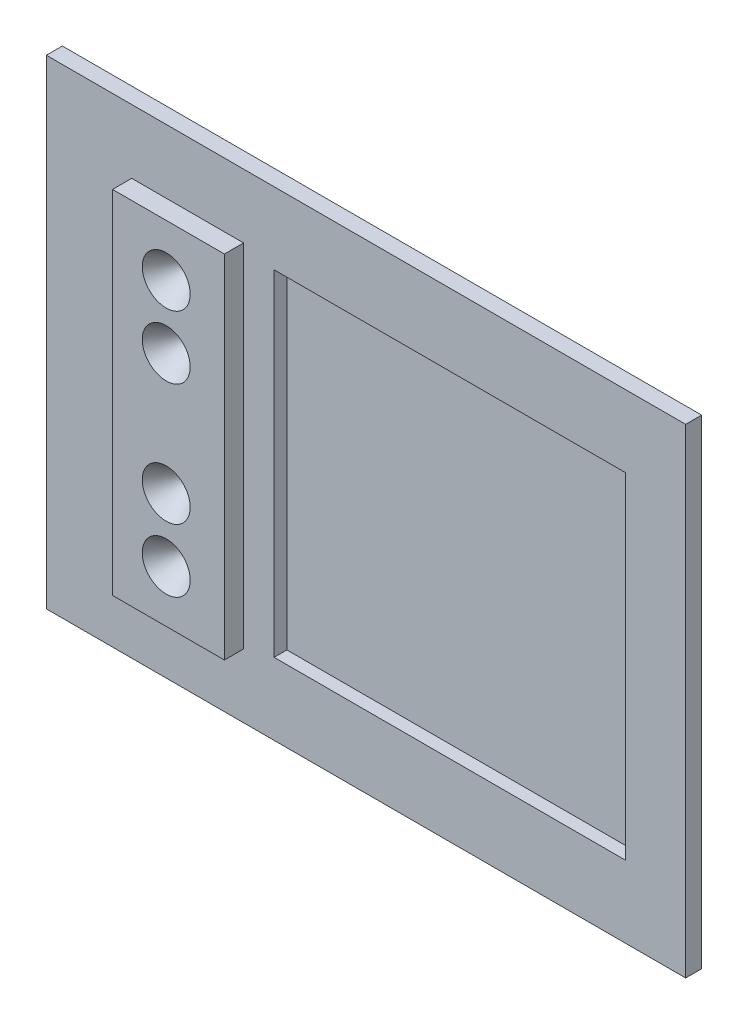
ISO-10303-21;
HEADER;
FILE_DESCRIPTION(('STEP AP214'),'2;1');
FILE_NAME('part.step','',(''),(''),'','','');
FILE_SCHEMA(('AUTOMOTIVE_DESIGN { 1 0 10303 214 1 1 1 1 }'));
ENDSEC;
DATA;
#1=APPLICATION_CONTEXT('core data for automotive mechanical design processes');
#2=APPLICATION_PROTOCOL_DEFINITION('international standard','automotive_design',2000,#1);
#3=PRODUCT_CONTEXT('',#1,'mechanical');
#4=PRODUCT('Part','Part','',(#3));
#5=PRODUCT_RELATED_PRODUCT_CATEGORY('part','',(#4));
#6=PRODUCT_DEFINITION_FORMATION('','',#4);
#7=PRODUCT_DEFINITION_CONTEXT('part definition',#1,'design');
#8=PRODUCT_DEFINITION('design','',#6,#7);
#9=PRODUCT_DEFINITION_SHAPE('','',#8);
#10=(LENGTH_UNIT() NAMED_UNIT(*) SI_UNIT(.MILLI.,.METRE.));
#11=(NAMED_UNIT(*) PLANE_ANGLE_UNIT() SI_UNIT($,.RADIAN.));
#12=(NAMED_UNIT(*) SI_UNIT($,.STERADIAN.) SOLID_ANGLE_UNIT());
#13=UNCERTAINTY_MEASURE_WITH_UNIT(LENGTH_MEASURE(1.E-05),#10,'distance_accuracy_value','');
#14=(GEOMETRIC_REPRESENTATION_CONTEXT(3) GLOBAL_UNCERTAINTY_ASSIGNED_CONTEXT((#13)) GLOBAL_UNIT_ASSIGNED_CONTEXT((#10,
#11,#12)) REPRESENTATION_CONTEXT('',''));
#15=CARTESIAN_POINT('',(0.,0.,0.));
#16=DIRECTION('',(0.,0.,1.));
#17=DIRECTION('',(1.,0.,0.));
#18=AXIS2_PLACEMENT_3D('',#15,#16,#17);
#19=CARTESIAN_POINT('',(0.,0.,1.));
#20=DIRECTION('',(0.,0.,1.));
#21=DIRECTION('',(1.,0.,0.));
#22=AXIS2_PLACEMENT_3D('',#19,#20,#21);
#23=PLANE('',#22);
#24=DIRECTION('',(0.,1.,0.));
#25=VECTOR('',#24,1.);
#26=CARTESIAN_POINT('',(16.25,10.5,1.));
#27=LINE('',#26,#25);
#28=CARTESIAN_POINT('',(16.25,-10.5,1.));
#29=VERTEX_POINT('',#28);
#30=CARTESIAN_POINT('',(16.25,10.5,1.));
#31=VERTEX_POINT('',#30);
#32=EDGE_CURVE('E59',#29,#31,#27,.T.);
#33=ORIENTED_EDGE('',*,*,#32,.F.);
#34=DIRECTION('',(1.,0.,0.));
#35=VECTOR('',#34,1.);
#36=CARTESIAN_POINT('',(-5.75,-10.5,1.));
#37=LINE('',#36,#35);
#38=CARTESIAN_POINT('',(-5.75,-10.5,1.));
#39=VERTEX_POINT('',#38);
#40=EDGE_CURVE('E160',#39,#29,#37,.T.);
#41=ORIENTED_EDGE('',*,*,#40,.F.);
#42=DIRECTION('',(0.,-1.,0.));
#43=VECTOR('',#42,1.);
#44=CARTESIAN_POINT('',(-5.75,10.5,1.));
#45=LINE('',#44,#43);
#46=CARTESIAN_POINT('',(-5.75,10.5,1.));
#47=VERTEX_POINT('',#46);
#48=EDGE_CURVE('E172',#47,#39,#45,.T.);
#49=ORIENTED_EDGE('',*,*,#48,.F.);
#50=DIRECTION('',(-1.,0.,0.));
#51=VECTOR('',#50,1.);
#52=CARTESIAN_POINT('',(-5.75,10.5,1.));
#53=LINE('',#52,#51);
#54=EDGE_CURVE('E151',#31,#47,#53,.T.);
#55=ORIENTED_EDGE('',*,*,#54,.F.);
#56=EDGE_LOOP('',(#33,#41,#49,#55));
#57=FACE_BOUND('',#56,.T.);
#58=DIRECTION('',(0.,1.,0.));
#59=VECTOR('',#58,1.);
#60=CARTESIAN_POINT('',(20.,15.,1.));
#61=LINE('',#60,#59);
#62=CARTESIAN_POINT('',(20.,-15.,1.));
#63=VERTEX_POINT('',#62);
#64=CARTESIAN_POINT('',(20.,15.,1.));
#65=VERTEX_POINT('',#64);
#66=EDGE_CURVE('E185',#63,#65,#61,.T.);
#67=ORIENTED_EDGE('',*,*,#66,.T.);
#68=DIRECTION('',(-1.,0.,0.));
#69=VECTOR('',#68,1.);
#70=CARTESIAN_POINT('',(-20.,15.,1.));
#71=LINE('',#70,#69);
#72=CARTESIAN_POINT('',(-20.,15.,1.));
#73=VERTEX_POINT('',#72);
#74=EDGE_CURVE('E188',#65,#73,#71,.T.);
#75=ORIENTED_EDGE('',*,*,#74,.T.);
#76=DIRECTION('',(0.,-1.,0.));
#77=VECTOR('',#76,1.);
#78=CARTESIAN_POINT('',(-20.,15.,1.));
#79=LINE('',#78,#77);
#80=CARTESIAN_POINT('',(-20.,-15.,1.));
#81=VERTEX_POINT('',#80);
#82=EDGE_CURVE('E191',#73,#81,#79,.T.);
#83=ORIENTED_EDGE('',*,*,#82,.T.);
#84=DIRECTION('',(1.,0.,0.));
#85=VECTOR('',#84,1.);
#86=CARTESIAN_POINT('',(-20.,-15.,1.));
#87=LINE('',#86,#85);
#88=EDGE_CURVE('E193',#81,#63,#87,.T.);
#89=ORIENTED_EDGE('',*,*,#88,.T.);
#90=EDGE_LOOP('',(#67,#75,#83,#89));
#91=FACE_BOUND('',#90,.T.);
#92=DIRECTION('',(-1.,0.,0.));
#93=VECTOR('',#92,1.);
#94=CARTESIAN_POINT('',(-14.66,11.,1.));
#95=LINE('',#94,#93);
#96=CARTESIAN_POINT('',(-7.66,11.,1.));
#97=VERTEX_POINT('',#96);
#98=CARTESIAN_POINT('',(-14.66,11.,1.));
#99=VERTEX_POINT('',#98);
#100=EDGE_CURVE('E338',#97,#99,#95,.T.);
#101=ORIENTED_EDGE('',*,*,#100,.F.);
#102=DIRECTION('',(0.,1.,0.));
#103=VECTOR('',#102,1.);
#104=CARTESIAN_POINT('',(-7.66,-11.,1.));
#105=LINE('',#104,#103);
#106=CARTESIAN_POINT('',(-7.66,-11.,1.));
#107=VERTEX_POINT('',#106);
#108=EDGE_CURVE('E148',#107,#97,#105,.T.);
#109=ORIENTED_EDGE('',*,*,#108,.F.);
#110=DIRECTION('',(1.,0.,0.));
#111=VECTOR('',#110,1.);
#112=CARTESIAN_POINT('',(-14.66,-11.,1.));
#113=LINE('',#112,#111);
#114=CARTESIAN_POINT('',(-14.66,-11.,1.));
#115=VERTEX_POINT('',#114);
#116=EDGE_CURVE('E144',#115,#107,#113,.T.);
#117=ORIENTED_EDGE('',*,*,#116,.F.);
#118=DIRECTION('',(0.,-1.,0.));
#119=VECTOR('',#118,1.);
#120=CARTESIAN_POINT('',(-14.66,-11.,1.));
#121=LINE('',#120,#119);
#122=EDGE_CURVE('E340',#99,#115,#121,.T.);
#123=ORIENTED_EDGE('',*,*,#122,.F.);
#124=EDGE_LOOP('',(#101,#109,#117,#123));
#125=FACE_BOUND('',#124,.T.);
#126=ADVANCED_FACE('F32',(#57,#91,#125),#23,.T.);
#127=CARTESIAN_POINT('',(20.,15.,1.));
#128=DIRECTION('',(-1.,0.,0.));
#129=DIRECTION('',(0.,-1.,0.));
#130=AXIS2_PLACEMENT_3D('',#127,#128,#129);
#131=PLANE('',#130);
#132=DIRECTION('',(0.,1.,0.));
#133=VECTOR('',#132,1.);
#134=CARTESIAN_POINT('',(20.,15.,0.));
#135=LINE('',#134,#133);
#136=CARTESIAN_POINT('',(20.,-15.,0.));
#137=VERTEX_POINT('',#136);
#138=CARTESIAN_POINT('',(20.,15.,0.));
#139=VERTEX_POINT('',#138);
#140=EDGE_CURVE('E179',#137,#139,#135,.T.);
#141=ORIENTED_EDGE('',*,*,#140,.T.);
#142=DIRECTION('',(0.,0.,-1.));
#143=VECTOR('',#142,1.);
#144=CARTESIAN_POINT('',(20.,15.,1.));
#145=LINE('',#144,#143);
#146=EDGE_CURVE('E11',#65,#139,#145,.T.);
#147=ORIENTED_EDGE('',*,*,#146,.F.);
#148=ORIENTED_EDGE('',*,*,#66,.F.);
#149=DIRECTION('',(0.,0.,-1.));
#150=VECTOR('',#149,1.);
#151=CARTESIAN_POINT('',(20.,-15.,1.));
#152=LINE('',#151,#150);
#153=EDGE_CURVE('E195',#63,#137,#152,.T.);
#154=ORIENTED_EDGE('',*,*,#153,.T.);
#155=EDGE_LOOP('',(#141,#147,#148,#154));
#156=FACE_BOUND('',#155,.T.);
#157=ADVANCED_FACE('F34',(#156),#131,.F.);
#158=CARTESIAN_POINT('',(-20.,15.,1.));
#159=DIRECTION('',(0.,-1.,0.));
#160=DIRECTION('',(0.,0.,-1.));
#161=AXIS2_PLACEMENT_3D('',#158,#159,#160);
#162=PLANE('',#161);
#163=DIRECTION('',(-1.,0.,0.));
#164=VECTOR('',#163,1.);
#165=CARTESIAN_POINT('',(-20.,15.,0.));
#166=LINE('',#165,#164);
#167=CARTESIAN_POINT('',(-20.,15.,0.));
#168=VERTEX_POINT('',#167);
#169=EDGE_CURVE('E198',#139,#168,#166,.T.);
#170=ORIENTED_EDGE('',*,*,#169,.T.);
#171=DIRECTION('',(0.,0.,-1.));
#172=VECTOR('',#171,1.);
#173=CARTESIAN_POINT('',(-20.,15.,1.));
#174=LINE('',#173,#172);
#175=EDGE_CURVE('E43',#73,#168,#174,.T.);
#176=ORIENTED_EDGE('',*,*,#175,.F.);
#177=ORIENTED_EDGE('',*,*,#74,.F.);
#178=ORIENTED_EDGE('',*,*,#146,.T.);
#179=EDGE_LOOP('',(#170,#176,#177,#178));
#180=FACE_BOUND('',#179,.T.);
#181=ADVANCED_FACE('F362',(#180),#162,.F.);
#182=CARTESIAN_POINT('',(-20.,15.,1.));
#183=DIRECTION('',(1.,0.,0.));
#184=DIRECTION('',(0.,0.,-1.));
#185=AXIS2_PLACEMENT_3D('',#182,#183,#184);
#186=PLANE('',#185);
#187=DIRECTION('',(0.,-1.,0.));
#188=VECTOR('',#187,1.);
#189=CARTESIAN_POINT('',(-20.,15.,0.));
#190=LINE('',#189,#188);
#191=CARTESIAN_POINT('',(-20.,-15.,0.));
#192=VERTEX_POINT('',#191);
#193=EDGE_CURVE('E200',#168,#192,#190,.T.);
#194=ORIENTED_EDGE('',*,*,#193,.T.);
#195=DIRECTION('',(0.,0.,-1.));
#196=VECTOR('',#195,1.);
#197=CARTESIAN_POINT('',(-20.,-15.,1.));
#198=LINE('',#197,#196);
#199=EDGE_CURVE('E205',#81,#192,#198,.T.);
#200=ORIENTED_EDGE('',*,*,#199,.F.);
#201=ORIENTED_EDGE('',*,*,#82,.F.);
#202=ORIENTED_EDGE('',*,*,#175,.T.);
#203=EDGE_LOOP('',(#194,#200,#201,#202));
#204=FACE_BOUND('',#203,.T.);
#205=ADVANCED_FACE('F376',(#204),#186,.F.);
#206=CARTESIAN_POINT('',(-20.,-15.,1.));
#207=DIRECTION('',(0.,1.,0.));
#208=DIRECTION('',(0.,0.,1.));
#209=AXIS2_PLACEMENT_3D('',#206,#207,#208);
#210=PLANE('',#209);
#211=DIRECTION('',(1.,0.,0.));
#212=VECTOR('',#211,1.);
#213=CARTESIAN_POINT('',(-20.,-15.,0.));
#214=LINE('',#213,#212);
#215=EDGE_CURVE('E189',#192,#137,#214,.T.);
#216=ORIENTED_EDGE('',*,*,#215,.T.);
#217=ORIENTED_EDGE('',*,*,#153,.F.);
#218=ORIENTED_EDGE('',*,*,#88,.F.);
#219=ORIENTED_EDGE('',*,*,#199,.T.);
#220=EDGE_LOOP('',(#216,#217,#218,#219));
#221=FACE_BOUND('',#220,.T.);
#222=ADVANCED_FACE('F372',(#221),#210,.F.);
#223=CARTESIAN_POINT('',(0.,0.,0.));
#224=DIRECTION('',(0.,0.,1.));
#225=DIRECTION('',(1.,0.,0.));
#226=AXIS2_PLACEMENT_3D('',#223,#224,#225);
#227=PLANE('',#226);
#228=ORIENTED_EDGE('',*,*,#140,.F.);
#229=ORIENTED_EDGE('',*,*,#215,.F.);
#230=ORIENTED_EDGE('',*,*,#193,.F.);
#231=ORIENTED_EDGE('',*,*,#169,.F.);
#232=EDGE_LOOP('',(#228,#229,#230,#231));
#233=FACE_BOUND('',#232,.T.);
#234=ADVANCED_FACE('F369',(#233),#227,.F.);
#235=CARTESIAN_POINT('',(16.25,10.5,0.2));
#236=DIRECTION('',(1.,0.,0.));
#237=DIRECTION('',(0.,1.,0.));
#238=AXIS2_PLACEMENT_3D('',#235,#236,#237);
#239=PLANE('',#238);
#240=ORIENTED_EDGE('',*,*,#32,.T.);
#241=DIRECTION('',(0.,0.,1.));
#242=VECTOR('',#241,1.);
#243=CARTESIAN_POINT('',(16.25,10.5,0.2));
#244=LINE('',#243,#242);
#245=CARTESIAN_POINT('',(16.25,10.5,0.2));
#246=VERTEX_POINT('',#245);
#247=EDGE_CURVE('E168',#246,#31,#244,.T.);
#248=ORIENTED_EDGE('',*,*,#247,.F.);
#249=DIRECTION('',(0.,1.,0.));
#250=VECTOR('',#249,1.);
#251=CARTESIAN_POINT('',(16.25,10.5,0.2));
#252=LINE('',#251,#250);
#253=CARTESIAN_POINT('',(16.25,-10.5,0.2));
#254=VERTEX_POINT('',#253);
#255=EDGE_CURVE('E156',#254,#246,#252,.T.);
#256=ORIENTED_EDGE('',*,*,#255,.F.);
#257=DIRECTION('',(0.,0.,1.));
#258=VECTOR('',#257,1.);
#259=CARTESIAN_POINT('',(16.25,-10.5,0.2));
#260=LINE('',#259,#258);
#261=EDGE_CURVE('E177',#254,#29,#260,.T.);
#262=ORIENTED_EDGE('',*,*,#261,.T.);
#263=EDGE_LOOP('',(#240,#248,#256,#262));
#264=FACE_BOUND('',#263,.T.);
#265=ADVANCED_FACE('F367',(#264),#239,.F.);
#266=CARTESIAN_POINT('',(-5.75,-10.5,0.2));
#267=DIRECTION('',(0.,-1.,0.));
#268=DIRECTION('',(0.,0.,-1.));
#269=AXIS2_PLACEMENT_3D('',#266,#267,#268);
#270=PLANE('',#269);
#271=ORIENTED_EDGE('',*,*,#40,.T.);
#272=ORIENTED_EDGE('',*,*,#261,.F.);
#273=DIRECTION('',(1.,0.,0.));
#274=VECTOR('',#273,1.);
#275=CARTESIAN_POINT('',(-5.75,-10.5,0.2));
#276=LINE('',#275,#274);
#277=CARTESIAN_POINT('',(-5.75,-10.5,0.2));
#278=VERTEX_POINT('',#277);
#279=EDGE_CURVE('E166',#278,#254,#276,.T.);
#280=ORIENTED_EDGE('',*,*,#279,.F.);
#281=DIRECTION('',(0.,0.,1.));
#282=VECTOR('',#281,1.);
#283=CARTESIAN_POINT('',(-5.75,-10.5,0.2));
#284=LINE('',#283,#282);
#285=EDGE_CURVE('E180',#278,#39,#284,.T.);
#286=ORIENTED_EDGE('',*,*,#285,.T.);
#287=EDGE_LOOP('',(#271,#272,#280,#286));
#288=FACE_BOUND('',#287,.T.);
#289=ADVANCED_FACE('F414',(#288),#270,.F.);
#290=CARTESIAN_POINT('',(-5.75,10.5,0.2));
#291=DIRECTION('',(-1.,0.,0.));
#292=DIRECTION('',(0.,-1.,0.));
#293=AXIS2_PLACEMENT_3D('',#290,#291,#292);
#294=PLANE('',#293);
#295=ORIENTED_EDGE('',*,*,#48,.T.);
#296=ORIENTED_EDGE('',*,*,#285,.F.);
#297=DIRECTION('',(0.,-1.,0.));
#298=VECTOR('',#297,1.);
#299=CARTESIAN_POINT('',(-5.75,10.5,0.2));
#300=LINE('',#299,#298);
#301=CARTESIAN_POINT('',(-5.75,10.5,0.2));
#302=VERTEX_POINT('',#301);
#303=EDGE_CURVE('E163',#302,#278,#300,.T.);
#304=ORIENTED_EDGE('',*,*,#303,.F.);
#305=DIRECTION('',(0.,0.,1.));
#306=VECTOR('',#305,1.);
#307=CARTESIAN_POINT('',(-5.75,10.5,0.2));
#308=LINE('',#307,#306);
#309=EDGE_CURVE('E182',#302,#47,#308,.T.);
#310=ORIENTED_EDGE('',*,*,#309,.T.);
#311=EDGE_LOOP('',(#295,#296,#304,#310));
#312=FACE_BOUND('',#311,.T.);
#313=ADVANCED_FACE('F420',(#312),#294,.F.);
#314=CARTESIAN_POINT('',(-5.75,10.5,0.2));
#315=DIRECTION('',(0.,1.,0.));
#316=DIRECTION('',(0.,0.,1.));
#317=AXIS2_PLACEMENT_3D('',#314,#315,#316);
#318=PLANE('',#317);
#319=ORIENTED_EDGE('',*,*,#54,.T.);
#320=ORIENTED_EDGE('',*,*,#309,.F.);
#321=DIRECTION('',(-1.,0.,0.));
#322=VECTOR('',#321,1.);
#323=CARTESIAN_POINT('',(-5.75,10.5,0.2));
#324=LINE('',#323,#322);
#325=EDGE_CURVE('E159',#246,#302,#324,.T.);
#326=ORIENTED_EDGE('',*,*,#325,.F.);
#327=ORIENTED_EDGE('',*,*,#247,.T.);
#328=EDGE_LOOP('',(#319,#320,#326,#327));
#329=FACE_BOUND('',#328,.T.);
#330=ADVANCED_FACE('F428',(#329),#318,.F.);
#331=CARTESIAN_POINT('',(0.,0.,0.2));
#332=DIRECTION('',(0.,0.,1.));
#333=DIRECTION('',(1.,0.,0.));
#334=AXIS2_PLACEMENT_3D('',#331,#332,#333);
#335=PLANE('',#334);
#336=ORIENTED_EDGE('',*,*,#255,.T.);
#337=ORIENTED_EDGE('',*,*,#325,.T.);
#338=ORIENTED_EDGE('',*,*,#303,.T.);
#339=ORIENTED_EDGE('',*,*,#279,.T.);
#340=EDGE_LOOP('',(#336,#337,#338,#339));
#341=FACE_BOUND('',#340,.T.);
#342=ADVANCED_FACE('F436',(#341),#335,.T.);
#343=CARTESIAN_POINT('',(-7.66,-11.,2.2));
#344=DIRECTION('',(-1.,0.,0.));
#345=DIRECTION('',(0.,0.,1.));
#346=AXIS2_PLACEMENT_3D('',#343,#344,#345);
#347=PLANE('',#346);
#348=ORIENTED_EDGE('',*,*,#108,.T.);
#349=DIRECTION('',(0.,0.,-1.));
#350=VECTOR('',#349,1.);
#351=CARTESIAN_POINT('',(-7.66,11.,2.2));
#352=LINE('',#351,#350);
#353=CARTESIAN_POINT('',(-7.66,11.,2.2));
#354=VERTEX_POINT('',#353);
#355=EDGE_CURVE('E129',#354,#97,#352,.T.);
#356=ORIENTED_EDGE('',*,*,#355,.F.);
#357=DIRECTION('',(0.,1.,0.));
#358=VECTOR('',#357,1.);
#359=CARTESIAN_POINT('',(-7.66,-11.,2.2));
#360=LINE('',#359,#358);
#361=CARTESIAN_POINT('',(-7.66,-11.,2.2));
#362=VERTEX_POINT('',#361);
#363=EDGE_CURVE('E136',#362,#354,#360,.T.);
#364=ORIENTED_EDGE('',*,*,#363,.F.);
#365=DIRECTION('',(0.,0.,-1.));
#366=VECTOR('',#365,1.);
#367=CARTESIAN_POINT('',(-7.66,-11.,2.2));
#368=LINE('',#367,#366);
#369=EDGE_CURVE('E336',#362,#107,#368,.T.);
#370=ORIENTED_EDGE('',*,*,#369,.T.);
#371=EDGE_LOOP('',(#348,#356,#364,#370));
#372=FACE_BOUND('',#371,.T.);
#373=ADVANCED_FACE('F146',(#372),#347,.F.);
#374=CARTESIAN_POINT('',(-14.66,11.,2.2));
#375=DIRECTION('',(0.,-1.,0.));
#376=DIRECTION('',(0.,0.,-1.));
#377=AXIS2_PLACEMENT_3D('',#374,#375,#376);
#378=PLANE('',#377);
#379=ORIENTED_EDGE('',*,*,#100,.T.);
#380=DIRECTION('',(0.,0.,-1.));
#381=VECTOR('',#380,1.);
#382=CARTESIAN_POINT('',(-14.66,11.,2.2));
#383=LINE('',#382,#381);
#384=CARTESIAN_POINT('',(-14.66,11.,2.2));
#385=VERTEX_POINT('',#384);
#386=EDGE_CURVE('E132',#385,#99,#383,.T.);
#387=ORIENTED_EDGE('',*,*,#386,.F.);
#388=DIRECTION('',(-1.,0.,0.));
#389=VECTOR('',#388,1.);
#390=CARTESIAN_POINT('',(-14.66,11.,2.2));
#391=LINE('',#390,#389);
#392=EDGE_CURVE('E125',#354,#385,#391,.T.);
#393=ORIENTED_EDGE('',*,*,#392,.F.);
#394=ORIENTED_EDGE('',*,*,#355,.T.);
#395=EDGE_LOOP('',(#379,#387,#393,#394));
#396=FACE_BOUND('',#395,.T.);
#397=ADVANCED_FACE('F127',(#396),#378,.F.);
#398=CARTESIAN_POINT('',(-14.66,-11.,2.2));
#399=DIRECTION('',(1.,0.,0.));
#400=DIRECTION('',(0.,0.,-1.));
#401=AXIS2_PLACEMENT_3D('',#398,#399,#400);
#402=PLANE('',#401);
#403=ORIENTED_EDGE('',*,*,#122,.T.);
#404=DIRECTION('',(0.,0.,-1.));
#405=VECTOR('',#404,1.);
#406=CARTESIAN_POINT('',(-14.66,-11.,2.2));
#407=LINE('',#406,#405);
#408=CARTESIAN_POINT('',(-14.66,-11.,2.2));
#409=VERTEX_POINT('',#408);
#410=EDGE_CURVE('E51',#409,#115,#407,.T.);
#411=ORIENTED_EDGE('',*,*,#410,.F.);
#412=DIRECTION('',(0.,-1.,0.));
#413=VECTOR('',#412,1.);
#414=CARTESIAN_POINT('',(-14.66,-11.,2.2));
#415=LINE('',#414,#413);
#416=EDGE_CURVE('E135',#385,#409,#415,.T.);
#417=ORIENTED_EDGE('',*,*,#416,.F.);
#418=ORIENTED_EDGE('',*,*,#386,.T.);
#419=EDGE_LOOP('',(#403,#411,#417,#418));
#420=FACE_BOUND('',#419,.T.);
#421=ADVANCED_FACE('F347',(#420),#402,.F.);
#422=CARTESIAN_POINT('',(-14.66,-11.,2.2));
#423=DIRECTION('',(0.,1.,0.));
#424=DIRECTION('',(0.,0.,1.));
#425=AXIS2_PLACEMENT_3D('',#422,#423,#424);
#426=PLANE('',#425);
#427=ORIENTED_EDGE('',*,*,#116,.T.);
#428=ORIENTED_EDGE('',*,*,#369,.F.);
#429=DIRECTION('',(1.,0.,0.));
#430=VECTOR('',#429,1.);
#431=CARTESIAN_POINT('',(-14.66,-11.,2.2));
#432=LINE('',#431,#430);
#433=EDGE_CURVE('E140',#409,#362,#432,.T.);
#434=ORIENTED_EDGE('',*,*,#433,.F.);
#435=ORIENTED_EDGE('',*,*,#410,.T.);
#436=EDGE_LOOP('',(#427,#428,#434,#435));
#437=FACE_BOUND('',#436,.T.);
#438=ADVANCED_FACE('F348',(#437),#426,.F.);
#439=CARTESIAN_POINT('',(0.,0.,2.2));
#440=DIRECTION('',(0.,0.,-1.));
#441=DIRECTION('',(-1.,0.,0.));
#442=AXIS2_PLACEMENT_3D('',#439,#440,#441);
#443=PLANE('',#442);
#444=CARTESIAN_POINT('',(-11.3,3.8,2.2));
#445=DIRECTION('',(0.,0.,1.));
#446=DIRECTION('',(1.,0.,0.));
#447=AXIS2_PLACEMENT_3D('',#444,#445,#446);
#448=CIRCLE('',#447,1.5);
#449=CARTESIAN_POINT('',(-9.8,3.8,2.2));
#450=VERTEX_POINT('',#449);
#451=EDGE_CURVE('E316',#450,#450,#448,.T.);
#452=ORIENTED_EDGE('',*,*,#451,.F.);
#453=EDGE_LOOP('',(#452));
#454=FACE_BOUND('',#453,.T.);
#455=CARTESIAN_POINT('',(-11.3,-3.8,2.2));
#456=DIRECTION('',(0.,0.,1.));
#457=DIRECTION('',(1.,0.,0.));
#458=AXIS2_PLACEMENT_3D('',#455,#456,#457);
#459=CIRCLE('',#458,1.5);
#460=CARTESIAN_POINT('',(-9.8,-3.8,2.2));
#461=VERTEX_POINT('',#460);
#462=EDGE_CURVE('E325',#461,#461,#459,.T.);
#463=ORIENTED_EDGE('',*,*,#462,.F.);
#464=EDGE_LOOP('',(#463));
#465=FACE_BOUND('',#464,.T.);
#466=CARTESIAN_POINT('',(-11.3,-7.75,2.2));
#467=DIRECTION('',(0.,0.,1.));
#468=DIRECTION('',(1.,0.,0.));
#469=AXIS2_PLACEMENT_3D('',#466,#467,#468);
#470=CIRCLE('',#469,1.5);
#471=CARTESIAN_POINT('',(-9.8,-7.75,2.2));
#472=VERTEX_POINT('',#471);
#473=EDGE_CURVE('E328',#472,#472,#470,.T.);
#474=ORIENTED_EDGE('',*,*,#473,.F.);
#475=EDGE_LOOP('',(#474));
#476=FACE_BOUND('',#475,.T.);
#477=CARTESIAN_POINT('',(-11.3,7.75,2.2));
#478=DIRECTION('',(0.,0.,1.));
#479=DIRECTION('',(1.,0.,0.));
#480=AXIS2_PLACEMENT_3D('',#477,#478,#479);
#481=CIRCLE('',#480,1.5);
#482=CARTESIAN_POINT('',(-9.8,7.75,2.2));
#483=VERTEX_POINT('',#482);
#484=EDGE_CURVE('E324',#483,#483,#481,.T.);
#485=ORIENTED_EDGE('',*,*,#484,.F.);
#486=EDGE_LOOP('',(#485));
#487=FACE_BOUND('',#486,.T.);
#488=ORIENTED_EDGE('',*,*,#363,.T.);
#489=ORIENTED_EDGE('',*,*,#392,.T.);
#490=ORIENTED_EDGE('',*,*,#416,.T.);
#491=ORIENTED_EDGE('',*,*,#433,.T.);
#492=EDGE_LOOP('',(#488,#489,#490,#491));
#493=FACE_BOUND('',#492,.T.);
#494=ADVANCED_FACE('F139',(#454,#465,#476,#487,#493),#443,.F.);
#495=CARTESIAN_POINT('',(-11.3,7.75,2.2));
#496=DIRECTION('',(0.,0.,1.));
#497=DIRECTION('',(1.,0.,0.));
#498=AXIS2_PLACEMENT_3D('',#495,#496,#497);
#499=CONICAL_SURFACE('',#498,1.5,0.575958653158129);
#500=CARTESIAN_POINT('',(-11.3,7.75,0.5));
#501=DIRECTION('',(0.,0.,1.));
#502=DIRECTION('',(1.,0.,0.));
#503=AXIS2_PLACEMENT_3D('',#500,#501,#502);
#504=CIRCLE('',#503,0.399999999999999);
#505=CARTESIAN_POINT('',(-10.9,7.75,0.5));
#506=VERTEX_POINT('',#505);
#507=EDGE_CURVE('E272',#506,#506,#504,.T.);
#508=ORIENTED_EDGE('',*,*,#507,.F.);
#509=EDGE_LOOP('',(#508));
#510=FACE_BOUND('',#509,.T.);
#511=ORIENTED_EDGE('',*,*,#484,.T.);
#512=EDGE_LOOP('',(#511));
#513=FACE_BOUND('',#512,.T.);
#514=ADVANCED_FACE('F232',(#510,#513),#499,.F.);
#515=CARTESIAN_POINT('',(-11.3,-7.75,2.2));
#516=DIRECTION('',(0.,0.,1.));
#517=DIRECTION('',(1.,0.,0.));
#518=AXIS2_PLACEMENT_3D('',#515,#516,#517);
#519=CONICAL_SURFACE('',#518,1.5,0.575958653158129);
#520=CARTESIAN_POINT('',(-11.3,-7.75,0.5));
#521=DIRECTION('',(0.,0.,1.));
#522=DIRECTION('',(1.,0.,0.));
#523=AXIS2_PLACEMENT_3D('',#520,#521,#522);
#524=CIRCLE('',#523,0.399999999999999);
#525=CARTESIAN_POINT('',(-10.9,-7.75,0.5));
#526=VERTEX_POINT('',#525);
#527=EDGE_CURVE('E214',#526,#526,#524,.T.);
#528=ORIENTED_EDGE('',*,*,#527,.F.);
#529=EDGE_LOOP('',(#528));
#530=FACE_BOUND('',#529,.T.);
#531=ORIENTED_EDGE('',*,*,#473,.T.);
#532=EDGE_LOOP('',(#531));
#533=FACE_BOUND('',#532,.T.);
#534=ADVANCED_FACE('F221',(#530,#533),#519,.F.);
#535=CARTESIAN_POINT('',(-11.3,-3.8,2.2));
#536=DIRECTION('',(0.,0.,1.));
#537=DIRECTION('',(1.,0.,0.));
#538=AXIS2_PLACEMENT_3D('',#535,#536,#537);
#539=CONICAL_SURFACE('',#538,1.5,0.575958653158129);
#540=CARTESIAN_POINT('',(-11.3,-3.8,0.5));
#541=DIRECTION('',(0.,0.,1.));
#542=DIRECTION('',(1.,0.,0.));
#543=AXIS2_PLACEMENT_3D('',#540,#541,#542);
#544=CIRCLE('',#543,0.399999999999999);
#545=CARTESIAN_POINT('',(-10.9,-3.8,0.5));
#546=VERTEX_POINT('',#545);
#547=EDGE_CURVE('E251',#546,#546,#544,.T.);
#548=ORIENTED_EDGE('',*,*,#547,.F.);
#549=EDGE_LOOP('',(#548));
#550=FACE_BOUND('',#549,.T.);
#551=ORIENTED_EDGE('',*,*,#462,.T.);
#552=EDGE_LOOP('',(#551));
#553=FACE_BOUND('',#552,.T.);
#554=ADVANCED_FACE('F231',(#550,#553),#539,.F.);
#555=CARTESIAN_POINT('',(-11.3,3.8,2.2));
#556=DIRECTION('',(0.,0.,1.));
#557=DIRECTION('',(1.,0.,0.));
#558=AXIS2_PLACEMENT_3D('',#555,#556,#557);
#559=CONICAL_SURFACE('',#558,1.5,0.575958653158129);
#560=CARTESIAN_POINT('',(-11.3,3.8,0.5));
#561=DIRECTION('',(0.,0.,1.));
#562=DIRECTION('',(1.,0.,0.));
#563=AXIS2_PLACEMENT_3D('',#560,#561,#562);
#564=CIRCLE('',#563,0.399999999999999);
#565=CARTESIAN_POINT('',(-10.9,3.8,0.5));
#566=VERTEX_POINT('',#565);
#567=EDGE_CURVE('E262',#566,#566,#564,.T.);
#568=ORIENTED_EDGE('',*,*,#567,.F.);
#569=EDGE_LOOP('',(#568));
#570=FACE_BOUND('',#569,.T.);
#571=ORIENTED_EDGE('',*,*,#451,.T.);
#572=EDGE_LOOP('',(#571));
#573=FACE_BOUND('',#572,.T.);
#574=ADVANCED_FACE('F263',(#570,#573),#559,.F.);
#575=CARTESIAN_POINT('',(-11.3,-7.75,0.2));
#576=DIRECTION('',(0.,0.,1.));
#577=DIRECTION('',(1.,0.,0.));
#578=AXIS2_PLACEMENT_3D('',#575,#576,#577);
#579=CYLINDRICAL_SURFACE('',#578,0.4);
#580=CARTESIAN_POINT('',(-11.3,-7.75,0.2));
#581=DIRECTION('',(0.,0.,1.));
#582=DIRECTION('',(1.,0.,0.));
#583=AXIS2_PLACEMENT_3D('',#580,#581,#582);
#584=CIRCLE('',#583,0.4);
#585=CARTESIAN_POINT('',(-10.9,-7.75,0.2));
#586=VERTEX_POINT('',#585);
#587=EDGE_CURVE('E331',#586,#586,#584,.T.);
#588=ORIENTED_EDGE('',*,*,#587,.F.);
#589=EDGE_LOOP('',(#588));
#590=FACE_BOUND('',#589,.T.);
#591=ORIENTED_EDGE('',*,*,#527,.T.);
#592=EDGE_LOOP('',(#591));
#593=FACE_BOUND('',#592,.T.);
#594=ADVANCED_FACE('F304',(#590,#593),#579,.F.);
#595=CARTESIAN_POINT('',(-11.3,-7.75,0.2));
#596=DIRECTION('',(0.,0.,1.));
#597=DIRECTION('',(1.,0.,0.));
#598=AXIS2_PLACEMENT_3D('',#595,#596,#597);
#599=PLANE('',#598);
#600=ORIENTED_EDGE('',*,*,#587,.T.);
#601=EDGE_LOOP('',(#600));
#602=FACE_BOUND('',#601,.T.);
#603=ADVANCED_FACE('F300',(#602),#599,.T.);
#604=CARTESIAN_POINT('',(-11.3,3.8,0.2));
#605=DIRECTION('',(0.,0.,1.));
#606=DIRECTION('',(1.,0.,0.));
#607=AXIS2_PLACEMENT_3D('',#604,#605,#606);
#608=CYLINDRICAL_SURFACE('',#607,0.399999999999999);
#609=CARTESIAN_POINT('',(-11.3,3.8,0.2));
#610=DIRECTION('',(0.,0.,1.));
#611=DIRECTION('',(1.,0.,0.));
#612=AXIS2_PLACEMENT_3D('',#609,#610,#611);
#613=CIRCLE('',#612,0.399999999999999);
#614=CARTESIAN_POINT('',(-10.9,3.8,0.2));
#615=VERTEX_POINT('',#614);
#616=EDGE_CURVE('E267',#615,#615,#613,.T.);
#617=ORIENTED_EDGE('',*,*,#616,.F.);
#618=EDGE_LOOP('',(#617));
#619=FACE_BOUND('',#618,.T.);
#620=ORIENTED_EDGE('',*,*,#567,.T.);
#621=EDGE_LOOP('',(#620));
#622=FACE_BOUND('',#621,.T.);
#623=ADVANCED_FACE('F303',(#619,#622),#608,.F.);
#624=CARTESIAN_POINT('',(-11.3,3.8,0.2));
#625=DIRECTION('',(0.,0.,1.));
#626=DIRECTION('',(1.,0.,0.));
#627=AXIS2_PLACEMENT_3D('',#624,#625,#626);
#628=PLANE('',#627);
#629=ORIENTED_EDGE('',*,*,#616,.T.);
#630=EDGE_LOOP('',(#629));
#631=FACE_BOUND('',#630,.T.);
#632=ADVANCED_FACE('F517',(#631),#628,.T.);
#633=CARTESIAN_POINT('',(-11.3,-3.8,0.2));
#634=DIRECTION('',(0.,0.,1.));
#635=DIRECTION('',(1.,0.,0.));
#636=AXIS2_PLACEMENT_3D('',#633,#634,#635);
#637=CYLINDRICAL_SURFACE('',#636,0.399999999999999);
#638=CARTESIAN_POINT('',(-11.3,-3.8,0.2));
#639=DIRECTION('',(0.,0.,1.));
#640=DIRECTION('',(1.,0.,0.));
#641=AXIS2_PLACEMENT_3D('',#638,#639,#640);
#642=CIRCLE('',#641,0.399999999999999);
#643=CARTESIAN_POINT('',(-10.9,-3.8,0.2));
#644=VERTEX_POINT('',#643);
#645=EDGE_CURVE('E582',#644,#644,#642,.T.);
#646=ORIENTED_EDGE('',*,*,#645,.F.);
#647=EDGE_LOOP('',(#646));
#648=FACE_BOUND('',#647,.T.);
#649=ORIENTED_EDGE('',*,*,#547,.T.);
#650=EDGE_LOOP('',(#649));
#651=FACE_BOUND('',#650,.T.);
#652=ADVANCED_FACE('F526',(#648,#651),#637,.F.);
#653=CARTESIAN_POINT('',(-11.3,-3.8,0.2));
#654=DIRECTION('',(0.,0.,1.));
#655=DIRECTION('',(1.,0.,0.));
#656=AXIS2_PLACEMENT_3D('',#653,#654,#655);
#657=PLANE('',#656);
#658=ORIENTED_EDGE('',*,*,#645,.T.);
#659=EDGE_LOOP('',(#658));
#660=FACE_BOUND('',#659,.T.);
#661=ADVANCED_FACE('F297',(#660),#657,.T.);
#662=CARTESIAN_POINT('',(-11.3,7.75,0.2));
#663=DIRECTION('',(0.,0.,1.));
#664=DIRECTION('',(1.,0.,0.));
#665=AXIS2_PLACEMENT_3D('',#662,#663,#664);
#666=CYLINDRICAL_SURFACE('',#665,0.399999999999999);
#667=CARTESIAN_POINT('',(-11.3,7.75,0.2));
#668=DIRECTION('',(0.,0.,1.));
#669=DIRECTION('',(1.,0.,0.));
#670=AXIS2_PLACEMENT_3D('',#667,#668,#669);
#671=CIRCLE('',#670,0.399999999999999);
#672=CARTESIAN_POINT('',(-10.9,7.75,0.2));
#673=VERTEX_POINT('',#672);
#674=EDGE_CURVE('E268',#673,#673,#671,.T.);
#675=ORIENTED_EDGE('',*,*,#674,.F.);
#676=EDGE_LOOP('',(#675));
#677=FACE_BOUND('',#676,.T.);
#678=ORIENTED_EDGE('',*,*,#507,.T.);
#679=EDGE_LOOP('',(#678));
#680=FACE_BOUND('',#679,.T.);
#681=ADVANCED_FACE('F286',(#677,#680),#666,.F.);
#682=CARTESIAN_POINT('',(-11.3,7.75,0.2));
#683=DIRECTION('',(0.,0.,1.));
#684=DIRECTION('',(1.,0.,0.));
#685=AXIS2_PLACEMENT_3D('',#682,#683,#684);
#686=PLANE('',#685);
#687=ORIENTED_EDGE('',*,*,#674,.T.);
#688=EDGE_LOOP('',(#687));
#689=FACE_BOUND('',#688,.T.);
#690=ADVANCED_FACE('F296',(#689),#686,.T.);
#691=CLOSED_SHELL('',(#126,#157,#181,#205,#222,#234,#265,#289,#313,#330,#342,#373,#397,#421,
#438,#494,#514,#534,#554,#574,#594,#603,#623,#632,#652,#661,#681,#690));
#692=MANIFOLD_SOLID_BREP('B2',#691);
#693=ADVANCED_BREP_SHAPE_REPRESENTATION('',(#18,#692),#14);
#694=SHAPE_DEFINITION_REPRESENTATION(#9,#693);
ENDSEC;
END-ISO-10303-21;
